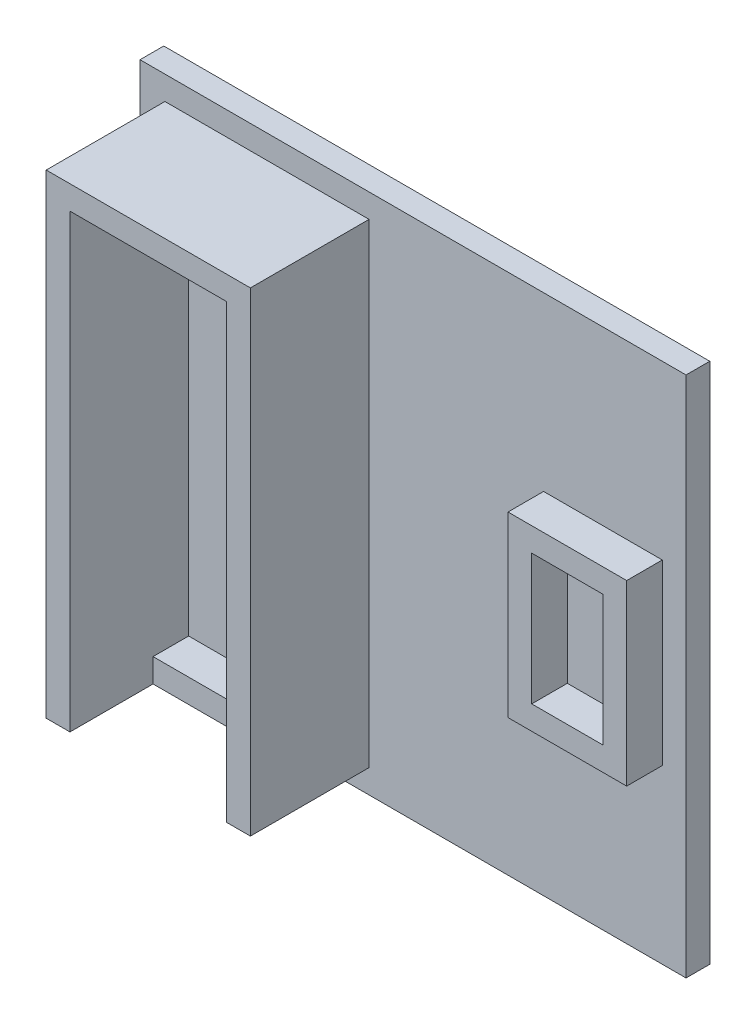
ISO-10303-21;
HEADER;
FILE_DESCRIPTION(('STEP AP214'),'2;1');
FILE_NAME('part.step','',(''),(''),'','','');
FILE_SCHEMA(('AUTOMOTIVE_DESIGN { 1 0 10303 214 1 1 1 1 }'));
ENDSEC;
DATA;
#1=APPLICATION_CONTEXT('core data for automotive mechanical design processes');
#2=APPLICATION_PROTOCOL_DEFINITION('international standard','automotive_design',2000,#1);
#3=PRODUCT_CONTEXT('',#1,'mechanical');
#4=PRODUCT('Part','Part','',(#3));
#5=PRODUCT_RELATED_PRODUCT_CATEGORY('part','',(#4));
#6=PRODUCT_DEFINITION_FORMATION('','',#4);
#7=PRODUCT_DEFINITION_CONTEXT('part definition',#1,'design');
#8=PRODUCT_DEFINITION('design','',#6,#7);
#9=PRODUCT_DEFINITION_SHAPE('','',#8);
#10=(LENGTH_UNIT() NAMED_UNIT(*) SI_UNIT(.MILLI.,.METRE.));
#11=(NAMED_UNIT(*) PLANE_ANGLE_UNIT() SI_UNIT($,.RADIAN.));
#12=(NAMED_UNIT(*) SI_UNIT($,.STERADIAN.) SOLID_ANGLE_UNIT());
#13=UNCERTAINTY_MEASURE_WITH_UNIT(LENGTH_MEASURE(1.E-05),#10,'distance_accuracy_value','');
#14=(GEOMETRIC_REPRESENTATION_CONTEXT(3) GLOBAL_UNCERTAINTY_ASSIGNED_CONTEXT((#13)) GLOBAL_UNIT_ASSIGNED_CONTEXT((#10,
#11,#12)) REPRESENTATION_CONTEXT('',''));
#15=CARTESIAN_POINT('',(0.,0.,0.));
#16=DIRECTION('',(0.,0.,1.));
#17=DIRECTION('',(1.,0.,0.));
#18=AXIS2_PLACEMENT_3D('',#15,#16,#17);
#19=CARTESIAN_POINT('',(0.,220.,10.));
#20=DIRECTION('',(0.,0.,-1.));
#21=DIRECTION('',(-1.,0.,0.));
#22=AXIS2_PLACEMENT_3D('',#19,#20,#21);
#23=PLANE('',#22);
#24=DIRECTION('',(0.,-1.,0.));
#25=VECTOR('',#24,1.);
#26=CARTESIAN_POINT('',(0.,0.,10.));
#27=LINE('',#26,#25);
#28=CARTESIAN_POINT('',(0.,220.,10.));
#29=VERTEX_POINT('',#28);
#30=CARTESIAN_POINT('',(0.,0.,10.));
#31=VERTEX_POINT('',#30);
#32=EDGE_CURVE('E329',#29,#31,#27,.T.);
#33=ORIENTED_EDGE('',*,*,#32,.T.);
#34=DIRECTION('',(1.,0.,0.));
#35=VECTOR('',#34,1.);
#36=CARTESIAN_POINT('',(0.,0.,10.));
#37=LINE('',#36,#35);
#38=CARTESIAN_POINT('',(230.,0.,10.));
#39=VERTEX_POINT('',#38);
#40=EDGE_CURVE('E332',#31,#39,#37,.T.);
#41=ORIENTED_EDGE('',*,*,#40,.T.);
#42=DIRECTION('',(0.,1.,0.));
#43=VECTOR('',#42,1.);
#44=CARTESIAN_POINT('',(230.,0.,10.));
#45=LINE('',#44,#43);
#46=CARTESIAN_POINT('',(230.,220.,10.));
#47=VERTEX_POINT('',#46);
#48=EDGE_CURVE('E335',#39,#47,#45,.T.);
#49=ORIENTED_EDGE('',*,*,#48,.T.);
#50=DIRECTION('',(-1.,0.,0.));
#51=VECTOR('',#50,1.);
#52=CARTESIAN_POINT('',(0.,220.,10.));
#53=LINE('',#52,#51);
#54=EDGE_CURVE('E337',#47,#29,#53,.T.);
#55=ORIENTED_EDGE('',*,*,#54,.T.);
#56=EDGE_LOOP('',(#33,#41,#49,#55));
#57=FACE_BOUND('',#56,.T.);
#58=DIRECTION('',(0.,1.,0.));
#59=VECTOR('',#58,1.);
#60=CARTESIAN_POINT('',(96.4871563645034,210.,10.));
#61=LINE('',#60,#59);
#62=CARTESIAN_POINT('',(96.4871563645034,9.99999999999995,10.));
#63=VERTEX_POINT('',#62);
#64=CARTESIAN_POINT('',(96.4871563645034,210.,10.));
#65=VERTEX_POINT('',#64);
#66=EDGE_CURVE('E300',#63,#65,#61,.T.);
#67=ORIENTED_EDGE('',*,*,#66,.F.);
#68=DIRECTION('',(1.,0.,0.));
#69=VECTOR('',#68,1.);
#70=CARTESIAN_POINT('',(10.4871563645034,9.99999999999995,10.));
#71=LINE('',#70,#69);
#72=CARTESIAN_POINT('',(10.4871563645034,9.99999999999995,10.));
#73=VERTEX_POINT('',#72);
#74=EDGE_CURVE('E290',#73,#63,#71,.T.);
#75=ORIENTED_EDGE('',*,*,#74,.F.);
#76=DIRECTION('',(0.,-1.,0.));
#77=VECTOR('',#76,1.);
#78=CARTESIAN_POINT('',(10.4871563645034,9.99999999999995,10.));
#79=LINE('',#78,#77);
#80=CARTESIAN_POINT('',(10.4871563645034,210.,10.));
#81=VERTEX_POINT('',#80);
#82=EDGE_CURVE('E268',#81,#73,#79,.T.);
#83=ORIENTED_EDGE('',*,*,#82,.F.);
#84=DIRECTION('',(-1.,0.,0.));
#85=VECTOR('',#84,1.);
#86=CARTESIAN_POINT('',(86.4871563645034,210.,10.));
#87=LINE('',#86,#85);
#88=EDGE_CURVE('E272',#65,#81,#87,.T.);
#89=ORIENTED_EDGE('',*,*,#88,.F.);
#90=EDGE_LOOP('',(#67,#75,#83,#89));
#91=FACE_BOUND('',#90,.T.);
#92=DIRECTION('',(0.,-1.,0.));
#93=VECTOR('',#92,1.);
#94=CARTESIAN_POINT('',(170.,147.5,10.));
#95=LINE('',#94,#93);
#96=CARTESIAN_POINT('',(170.,147.5,10.));
#97=VERTEX_POINT('',#96);
#98=CARTESIAN_POINT('',(170.,72.5,10.));
#99=VERTEX_POINT('',#98);
#100=EDGE_CURVE('E201',#97,#99,#95,.T.);
#101=ORIENTED_EDGE('',*,*,#100,.F.);
#102=DIRECTION('',(-1.,0.,0.));
#103=VECTOR('',#102,1.);
#104=CARTESIAN_POINT('',(170.,147.5,10.));
#105=LINE('',#104,#103);
#106=CARTESIAN_POINT('',(220.,147.5,10.));
#107=VERTEX_POINT('',#106);
#108=EDGE_CURVE('E229',#107,#97,#105,.T.);
#109=ORIENTED_EDGE('',*,*,#108,.F.);
#110=DIRECTION('',(0.,1.,0.));
#111=VECTOR('',#110,1.);
#112=CARTESIAN_POINT('',(220.,147.5,10.));
#113=LINE('',#112,#111);
#114=CARTESIAN_POINT('',(220.,72.5,10.));
#115=VERTEX_POINT('',#114);
#116=EDGE_CURVE('E55',#115,#107,#113,.T.);
#117=ORIENTED_EDGE('',*,*,#116,.F.);
#118=DIRECTION('',(1.,0.,0.));
#119=VECTOR('',#118,1.);
#120=CARTESIAN_POINT('',(170.,72.5,10.));
#121=LINE('',#120,#119);
#122=EDGE_CURVE('E50',#99,#115,#121,.T.);
#123=ORIENTED_EDGE('',*,*,#122,.F.);
#124=EDGE_LOOP('',(#101,#109,#117,#123));
#125=FACE_BOUND('',#124,.T.);
#126=ADVANCED_FACE('F35',(#57,#91,#125),#23,.F.);
#127=DIRECTION('',(-1.,0.,0.));
#128=VECTOR('',#127,1.);
#129=CARTESIAN_POINT('',(20.4871563645034,20.,10.));
#130=LINE('',#129,#128);
#131=CARTESIAN_POINT('',(86.4871563645034,20.,10.));
#132=VERTEX_POINT('',#131);
#133=CARTESIAN_POINT('',(20.4871563645034,20.,10.));
#134=VERTEX_POINT('',#133);
#135=EDGE_CURVE('E252',#132,#134,#130,.T.);
#136=ORIENTED_EDGE('',*,*,#135,.F.);
#137=DIRECTION('',(0.,-1.,0.));
#138=VECTOR('',#137,1.);
#139=CARTESIAN_POINT('',(86.4871563645034,200.,10.));
#140=LINE('',#139,#138);
#141=CARTESIAN_POINT('',(86.4871563645034,200.,10.));
#142=VERTEX_POINT('',#141);
#143=EDGE_CURVE('E297',#142,#132,#140,.T.);
#144=ORIENTED_EDGE('',*,*,#143,.F.);
#145=DIRECTION('',(1.,0.,0.));
#146=VECTOR('',#145,1.);
#147=CARTESIAN_POINT('',(20.4871563645034,200.,10.));
#148=LINE('',#147,#146);
#149=CARTESIAN_POINT('',(20.4871563645034,200.,10.));
#150=VERTEX_POINT('',#149);
#151=EDGE_CURVE('E294',#150,#142,#148,.T.);
#152=ORIENTED_EDGE('',*,*,#151,.F.);
#153=DIRECTION('',(0.,1.,0.));
#154=VECTOR('',#153,1.);
#155=CARTESIAN_POINT('',(20.4871563645034,9.99999999999995,10.));
#156=LINE('',#155,#154);
#157=EDGE_CURVE('E292',#134,#150,#156,.T.);
#158=ORIENTED_EDGE('',*,*,#157,.F.);
#159=EDGE_LOOP('',(#136,#144,#152,#158));
#160=FACE_BOUND('',#159,.T.);
#161=ADVANCED_FACE('F381',(#160),#23,.F.);
#162=CARTESIAN_POINT('',(20.4871563645034,9.99999999999995,60.));
#163=DIRECTION('',(-1.,0.,0.));
#164=DIRECTION('',(0.,0.,1.));
#165=AXIS2_PLACEMENT_3D('',#162,#163,#164);
#166=PLANE('',#165);
#167=DIRECTION('',(0.,0.,-1.));
#168=VECTOR('',#167,1.);
#169=CARTESIAN_POINT('',(20.4871563645034,20.,25.));
#170=LINE('',#169,#168);
#171=CARTESIAN_POINT('',(20.4871563645034,20.,25.));
#172=VERTEX_POINT('',#171);
#173=EDGE_CURVE('E262',#172,#134,#170,.T.);
#174=ORIENTED_EDGE('',*,*,#173,.T.);
#175=ORIENTED_EDGE('',*,*,#157,.T.);
#176=DIRECTION('',(0.,0.,-1.));
#177=VECTOR('',#176,1.);
#178=CARTESIAN_POINT('',(20.4871563645034,200.,60.));
#179=LINE('',#178,#177);
#180=CARTESIAN_POINT('',(20.4871563645034,200.,60.));
#181=VERTEX_POINT('',#180);
#182=EDGE_CURVE('E316',#181,#150,#179,.T.);
#183=ORIENTED_EDGE('',*,*,#182,.F.);
#184=DIRECTION('',(0.,1.,0.));
#185=VECTOR('',#184,1.);
#186=CARTESIAN_POINT('',(20.4871563645034,9.99999999999995,60.));
#187=LINE('',#186,#185);
#188=CARTESIAN_POINT('',(20.4871563645034,9.99999999999995,60.));
#189=VERTEX_POINT('',#188);
#190=EDGE_CURVE('E276',#189,#181,#187,.T.);
#191=ORIENTED_EDGE('',*,*,#190,.F.);
#192=DIRECTION('',(0.,0.,-1.));
#193=VECTOR('',#192,1.);
#194=CARTESIAN_POINT('',(20.4871563645034,9.99999999999995,60.));
#195=LINE('',#194,#193);
#196=CARTESIAN_POINT('',(20.4871563645034,9.99999999999995,25.));
#197=VERTEX_POINT('',#196);
#198=EDGE_CURVE('E319',#189,#197,#195,.T.);
#199=ORIENTED_EDGE('',*,*,#198,.T.);
#200=DIRECTION('',(0.,-1.,0.));
#201=VECTOR('',#200,1.);
#202=CARTESIAN_POINT('',(20.4871563645034,9.99999999999995,25.));
#203=LINE('',#202,#201);
#204=EDGE_CURVE('E253',#172,#197,#203,.T.);
#205=ORIENTED_EDGE('',*,*,#204,.F.);
#206=EDGE_LOOP('',(#174,#175,#183,#191,#199,#205));
#207=FACE_BOUND('',#206,.T.);
#208=ADVANCED_FACE('F387',(#207),#166,.F.);
#209=CARTESIAN_POINT('',(86.4871563645034,200.,60.));
#210=DIRECTION('',(1.,0.,0.));
#211=DIRECTION('',(0.,1.,0.));
#212=AXIS2_PLACEMENT_3D('',#209,#210,#211);
#213=PLANE('',#212);
#214=DIRECTION('',(0.,0.,-1.));
#215=VECTOR('',#214,1.);
#216=CARTESIAN_POINT('',(86.4871563645034,20.,25.));
#217=LINE('',#216,#215);
#218=CARTESIAN_POINT('',(86.4871563645034,20.,25.));
#219=VERTEX_POINT('',#218);
#220=EDGE_CURVE('E266',#219,#132,#217,.T.);
#221=ORIENTED_EDGE('',*,*,#220,.F.);
#222=DIRECTION('',(0.,1.,0.));
#223=VECTOR('',#222,1.);
#224=CARTESIAN_POINT('',(86.4871563645034,9.99999999999995,25.));
#225=LINE('',#224,#223);
#226=CARTESIAN_POINT('',(86.4871563645034,9.99999999999995,25.));
#227=VERTEX_POINT('',#226);
#228=EDGE_CURVE('E258',#227,#219,#225,.T.);
#229=ORIENTED_EDGE('',*,*,#228,.F.);
#230=DIRECTION('',(0.,0.,-1.));
#231=VECTOR('',#230,1.);
#232=CARTESIAN_POINT('',(86.4871563645034,9.99999999999996,60.));
#233=LINE('',#232,#231);
#234=CARTESIAN_POINT('',(86.4871563645034,9.99999999999996,60.));
#235=VERTEX_POINT('',#234);
#236=EDGE_CURVE('E310',#235,#227,#233,.T.);
#237=ORIENTED_EDGE('',*,*,#236,.F.);
#238=DIRECTION('',(0.,-1.,0.));
#239=VECTOR('',#238,1.);
#240=CARTESIAN_POINT('',(86.4871563645034,200.,60.));
#241=LINE('',#240,#239);
#242=CARTESIAN_POINT('',(86.4871563645034,200.,60.));
#243=VERTEX_POINT('',#242);
#244=EDGE_CURVE('E280',#243,#235,#241,.T.);
#245=ORIENTED_EDGE('',*,*,#244,.F.);
#246=DIRECTION('',(0.,0.,-1.));
#247=VECTOR('',#246,1.);
#248=CARTESIAN_POINT('',(86.4871563645034,200.,60.));
#249=LINE('',#248,#247);
#250=EDGE_CURVE('E313',#243,#142,#249,.T.);
#251=ORIENTED_EDGE('',*,*,#250,.T.);
#252=ORIENTED_EDGE('',*,*,#143,.T.);
#253=EDGE_LOOP('',(#221,#229,#237,#245,#251,#252));
#254=FACE_BOUND('',#253,.T.);
#255=ADVANCED_FACE('F379',(#254),#213,.F.);
#256=CARTESIAN_POINT('',(0.,0.,10.));
#257=DIRECTION('',(1.,0.,0.));
#258=DIRECTION('',(0.,0.,-1.));
#259=AXIS2_PLACEMENT_3D('',#256,#257,#258);
#260=PLANE('',#259);
#261=DIRECTION('',(0.,-1.,0.));
#262=VECTOR('',#261,1.);
#263=CARTESIAN_POINT('',(0.,0.,0.));
#264=LINE('',#263,#262);
#265=CARTESIAN_POINT('',(0.,220.,0.));
#266=VERTEX_POINT('',#265);
#267=CARTESIAN_POINT('',(0.,0.,0.));
#268=VERTEX_POINT('',#267);
#269=EDGE_CURVE('E328',#266,#268,#264,.T.);
#270=ORIENTED_EDGE('',*,*,#269,.T.);
#271=DIRECTION('',(0.,0.,-1.));
#272=VECTOR('',#271,1.);
#273=CARTESIAN_POINT('',(0.,0.,10.));
#274=LINE('',#273,#272);
#275=EDGE_CURVE('E11',#31,#268,#274,.T.);
#276=ORIENTED_EDGE('',*,*,#275,.F.);
#277=ORIENTED_EDGE('',*,*,#32,.F.);
#278=DIRECTION('',(0.,0.,-1.));
#279=VECTOR('',#278,1.);
#280=CARTESIAN_POINT('',(0.,220.,10.));
#281=LINE('',#280,#279);
#282=EDGE_CURVE('E339',#29,#266,#281,.T.);
#283=ORIENTED_EDGE('',*,*,#282,.T.);
#284=EDGE_LOOP('',(#270,#276,#277,#283));
#285=FACE_BOUND('',#284,.T.);
#286=ADVANCED_FACE('F37',(#285),#260,.F.);
#287=CARTESIAN_POINT('',(0.,0.,10.));
#288=DIRECTION('',(0.,1.,0.));
#289=DIRECTION('',(0.,0.,1.));
#290=AXIS2_PLACEMENT_3D('',#287,#288,#289);
#291=PLANE('',#290);
#292=DIRECTION('',(1.,0.,0.));
#293=VECTOR('',#292,1.);
#294=CARTESIAN_POINT('',(0.,0.,0.));
#295=LINE('',#294,#293);
#296=CARTESIAN_POINT('',(230.,0.,0.));
#297=VERTEX_POINT('',#296);
#298=EDGE_CURVE('E342',#268,#297,#295,.T.);
#299=ORIENTED_EDGE('',*,*,#298,.T.);
#300=DIRECTION('',(0.,0.,-1.));
#301=VECTOR('',#300,1.);
#302=CARTESIAN_POINT('',(230.,0.,10.));
#303=LINE('',#302,#301);
#304=EDGE_CURVE('E43',#39,#297,#303,.T.);
#305=ORIENTED_EDGE('',*,*,#304,.F.);
#306=ORIENTED_EDGE('',*,*,#40,.F.);
#307=ORIENTED_EDGE('',*,*,#275,.T.);
#308=EDGE_LOOP('',(#299,#305,#306,#307));
#309=FACE_BOUND('',#308,.T.);
#310=ADVANCED_FACE('F372',(#309),#291,.F.);
#311=CARTESIAN_POINT('',(230.,0.,10.));
#312=DIRECTION('',(-1.,0.,0.));
#313=DIRECTION('',(0.,0.,1.));
#314=AXIS2_PLACEMENT_3D('',#311,#312,#313);
#315=PLANE('',#314);
#316=DIRECTION('',(0.,1.,0.));
#317=VECTOR('',#316,1.);
#318=CARTESIAN_POINT('',(230.,0.,0.));
#319=LINE('',#318,#317);
#320=CARTESIAN_POINT('',(230.,220.,0.));
#321=VERTEX_POINT('',#320);
#322=EDGE_CURVE('E344',#297,#321,#319,.T.);
#323=ORIENTED_EDGE('',*,*,#322,.T.);
#324=DIRECTION('',(0.,0.,-1.));
#325=VECTOR('',#324,1.);
#326=CARTESIAN_POINT('',(230.,220.,10.));
#327=LINE('',#326,#325);
#328=EDGE_CURVE('E349',#47,#321,#327,.T.);
#329=ORIENTED_EDGE('',*,*,#328,.F.);
#330=ORIENTED_EDGE('',*,*,#48,.F.);
#331=ORIENTED_EDGE('',*,*,#304,.T.);
#332=EDGE_LOOP('',(#323,#329,#330,#331));
#333=FACE_BOUND('',#332,.T.);
#334=ADVANCED_FACE('F356',(#333),#315,.F.);
#335=CARTESIAN_POINT('',(0.,220.,10.));
#336=DIRECTION('',(0.,-1.,0.));
#337=DIRECTION('',(0.,0.,-1.));
#338=AXIS2_PLACEMENT_3D('',#335,#336,#337);
#339=PLANE('',#338);
#340=DIRECTION('',(-1.,0.,0.));
#341=VECTOR('',#340,1.);
#342=CARTESIAN_POINT('',(0.,220.,0.));
#343=LINE('',#342,#341);
#344=EDGE_CURVE('E333',#321,#266,#343,.T.);
#345=ORIENTED_EDGE('',*,*,#344,.T.);
#346=ORIENTED_EDGE('',*,*,#282,.F.);
#347=ORIENTED_EDGE('',*,*,#54,.F.);
#348=ORIENTED_EDGE('',*,*,#328,.T.);
#349=EDGE_LOOP('',(#345,#346,#347,#348));
#350=FACE_BOUND('',#349,.T.);
#351=ADVANCED_FACE('F365',(#350),#339,.F.);
#352=CARTESIAN_POINT('',(0.,220.,0.));
#353=DIRECTION('',(0.,0.,-1.));
#354=DIRECTION('',(-1.,0.,0.));
#355=AXIS2_PLACEMENT_3D('',#352,#353,#354);
#356=PLANE('',#355);
#357=ORIENTED_EDGE('',*,*,#269,.F.);
#358=ORIENTED_EDGE('',*,*,#344,.F.);
#359=ORIENTED_EDGE('',*,*,#322,.F.);
#360=ORIENTED_EDGE('',*,*,#298,.F.);
#361=EDGE_LOOP('',(#357,#358,#359,#360));
#362=FACE_BOUND('',#361,.T.);
#363=ADVANCED_FACE('F362',(#362),#356,.T.);
#364=CARTESIAN_POINT('',(10.4871563645034,9.99999999999995,60.));
#365=DIRECTION('',(1.,0.,0.));
#366=DIRECTION('',(0.,0.,-1.));
#367=AXIS2_PLACEMENT_3D('',#364,#365,#366);
#368=PLANE('',#367);
#369=ORIENTED_EDGE('',*,*,#82,.T.);
#370=DIRECTION('',(0.,0.,-1.));
#371=VECTOR('',#370,1.);
#372=CARTESIAN_POINT('',(10.4871563645034,9.99999999999995,60.));
#373=LINE('',#372,#371);
#374=CARTESIAN_POINT('',(10.4871563645034,9.99999999999995,60.));
#375=VERTEX_POINT('',#374);
#376=EDGE_CURVE('E322',#375,#73,#373,.T.);
#377=ORIENTED_EDGE('',*,*,#376,.F.);
#378=DIRECTION('',(0.,-1.,0.));
#379=VECTOR('',#378,1.);
#380=CARTESIAN_POINT('',(10.4871563645034,9.99999999999995,60.));
#381=LINE('',#380,#379);
#382=CARTESIAN_POINT('',(10.4871563645034,210.,60.));
#383=VERTEX_POINT('',#382);
#384=EDGE_CURVE('E271',#383,#375,#381,.T.);
#385=ORIENTED_EDGE('',*,*,#384,.F.);
#386=DIRECTION('',(0.,0.,-1.));
#387=VECTOR('',#386,1.);
#388=CARTESIAN_POINT('',(10.4871563645034,210.,60.));
#389=LINE('',#388,#387);
#390=EDGE_CURVE('E325',#383,#81,#389,.T.);
#391=ORIENTED_EDGE('',*,*,#390,.T.);
#392=EDGE_LOOP('',(#369,#377,#385,#391));
#393=FACE_BOUND('',#392,.T.);
#394=ADVANCED_FACE('F463',(#393),#368,.F.);
#395=CARTESIAN_POINT('',(10.4871563645034,9.99999999999995,60.));
#396=DIRECTION('',(0.,1.,0.));
#397=DIRECTION('',(0.,0.,1.));
#398=AXIS2_PLACEMENT_3D('',#395,#396,#397);
#399=PLANE('',#398);
#400=ORIENTED_EDGE('',*,*,#74,.T.);
#401=DIRECTION('',(0.,0.,-1.));
#402=VECTOR('',#401,1.);
#403=CARTESIAN_POINT('',(96.4871563645034,9.99999999999995,60.));
#404=LINE('',#403,#402);
#405=CARTESIAN_POINT('',(96.4871563645034,9.99999999999995,60.));
#406=VERTEX_POINT('',#405);
#407=EDGE_CURVE('E307',#406,#63,#404,.T.);
#408=ORIENTED_EDGE('',*,*,#407,.F.);
#409=DIRECTION('',(1.,0.,0.));
#410=VECTOR('',#409,1.);
#411=CARTESIAN_POINT('',(86.4871563645034,9.99999999999996,60.));
#412=LINE('',#411,#410);
#413=EDGE_CURVE('E282',#235,#406,#412,.T.);
#414=ORIENTED_EDGE('',*,*,#413,.F.);
#415=ORIENTED_EDGE('',*,*,#236,.T.);
#416=DIRECTION('',(1.,0.,0.));
#417=VECTOR('',#416,1.);
#418=CARTESIAN_POINT('',(20.4871563645034,9.99999999999995,25.));
#419=LINE('',#418,#417);
#420=EDGE_CURVE('E256',#197,#227,#419,.T.);
#421=ORIENTED_EDGE('',*,*,#420,.F.);
#422=ORIENTED_EDGE('',*,*,#198,.F.);
#423=DIRECTION('',(1.,0.,0.));
#424=VECTOR('',#423,1.);
#425=CARTESIAN_POINT('',(10.4871563645034,9.99999999999995,60.));
#426=LINE('',#425,#424);
#427=EDGE_CURVE('E274',#375,#189,#426,.T.);
#428=ORIENTED_EDGE('',*,*,#427,.F.);
#429=ORIENTED_EDGE('',*,*,#376,.T.);
#430=EDGE_LOOP('',(#400,#408,#414,#415,#421,#422,#428,#429));
#431=FACE_BOUND('',#430,.T.);
#432=ADVANCED_FACE('F457',(#431),#399,.F.);
#433=CARTESIAN_POINT('',(20.4871563645034,200.,60.));
#434=DIRECTION('',(0.,1.,0.));
#435=DIRECTION('',(-1.,0.,0.));
#436=AXIS2_PLACEMENT_3D('',#433,#434,#435);
#437=PLANE('',#436);
#438=ORIENTED_EDGE('',*,*,#151,.T.);
#439=ORIENTED_EDGE('',*,*,#250,.F.);
#440=DIRECTION('',(1.,0.,0.));
#441=VECTOR('',#440,1.);
#442=CARTESIAN_POINT('',(20.4871563645034,200.,60.));
#443=LINE('',#442,#441);
#444=EDGE_CURVE('E278',#181,#243,#443,.T.);
#445=ORIENTED_EDGE('',*,*,#444,.F.);
#446=ORIENTED_EDGE('',*,*,#182,.T.);
#447=EDGE_LOOP('',(#438,#439,#445,#446));
#448=FACE_BOUND('',#447,.T.);
#449=ADVANCED_FACE('F450',(#448),#437,.F.);
#450=CARTESIAN_POINT('',(96.4871563645034,210.,60.));
#451=DIRECTION('',(-1.,0.,0.));
#452=DIRECTION('',(0.,-1.,0.));
#453=AXIS2_PLACEMENT_3D('',#450,#451,#452);
#454=PLANE('',#453);
#455=ORIENTED_EDGE('',*,*,#66,.T.);
#456=DIRECTION('',(0.,0.,-1.));
#457=VECTOR('',#456,1.);
#458=CARTESIAN_POINT('',(96.4871563645034,210.,60.));
#459=LINE('',#458,#457);
#460=CARTESIAN_POINT('',(96.4871563645034,210.,60.));
#461=VERTEX_POINT('',#460);
#462=EDGE_CURVE('E287',#461,#65,#459,.T.);
#463=ORIENTED_EDGE('',*,*,#462,.F.);
#464=DIRECTION('',(0.,1.,0.));
#465=VECTOR('',#464,1.);
#466=CARTESIAN_POINT('',(96.4871563645034,210.,60.));
#467=LINE('',#466,#465);
#468=EDGE_CURVE('E284',#406,#461,#467,.T.);
#469=ORIENTED_EDGE('',*,*,#468,.F.);
#470=ORIENTED_EDGE('',*,*,#407,.T.);
#471=EDGE_LOOP('',(#455,#463,#469,#470));
#472=FACE_BOUND('',#471,.T.);
#473=ADVANCED_FACE('F446',(#472),#454,.F.);
#474=CARTESIAN_POINT('',(86.4871563645034,210.,60.));
#475=DIRECTION('',(0.,-1.,0.));
#476=DIRECTION('',(1.,0.,0.));
#477=AXIS2_PLACEMENT_3D('',#474,#475,#476);
#478=PLANE('',#477);
#479=ORIENTED_EDGE('',*,*,#88,.T.);
#480=ORIENTED_EDGE('',*,*,#390,.F.);
#481=DIRECTION('',(-1.,0.,0.));
#482=VECTOR('',#481,1.);
#483=CARTESIAN_POINT('',(20.4871563645034,210.,60.));
#484=LINE('',#483,#482);
#485=EDGE_CURVE('E269',#461,#383,#484,.T.);
#486=ORIENTED_EDGE('',*,*,#485,.F.);
#487=ORIENTED_EDGE('',*,*,#462,.T.);
#488=EDGE_LOOP('',(#479,#480,#486,#487));
#489=FACE_BOUND('',#488,.T.);
#490=ADVANCED_FACE('F442',(#489),#478,.F.);
#491=CARTESIAN_POINT('',(96.4871563645034,210.,60.));
#492=DIRECTION('',(0.,0.,-1.));
#493=DIRECTION('',(-1.,0.,0.));
#494=AXIS2_PLACEMENT_3D('',#491,#492,#493);
#495=PLANE('',#494);
#496=ORIENTED_EDGE('',*,*,#485,.T.);
#497=ORIENTED_EDGE('',*,*,#384,.T.);
#498=ORIENTED_EDGE('',*,*,#427,.T.);
#499=ORIENTED_EDGE('',*,*,#190,.T.);
#500=ORIENTED_EDGE('',*,*,#444,.T.);
#501=ORIENTED_EDGE('',*,*,#244,.T.);
#502=ORIENTED_EDGE('',*,*,#413,.T.);
#503=ORIENTED_EDGE('',*,*,#468,.T.);
#504=EDGE_LOOP('',(#496,#497,#498,#499,#500,#501,#502,#503));
#505=FACE_BOUND('',#504,.T.);
#506=ADVANCED_FACE('F438',(#505),#495,.F.);
#507=CARTESIAN_POINT('',(20.4871563645034,20.,25.));
#508=DIRECTION('',(0.,-1.,0.));
#509=DIRECTION('',(1.,0.,0.));
#510=AXIS2_PLACEMENT_3D('',#507,#508,#509);
#511=PLANE('',#510);
#512=ORIENTED_EDGE('',*,*,#135,.T.);
#513=ORIENTED_EDGE('',*,*,#173,.F.);
#514=DIRECTION('',(-1.,0.,0.));
#515=VECTOR('',#514,1.);
#516=CARTESIAN_POINT('',(20.4871563645034,20.,25.));
#517=LINE('',#516,#515);
#518=EDGE_CURVE('E260',#219,#172,#517,.T.);
#519=ORIENTED_EDGE('',*,*,#518,.F.);
#520=ORIENTED_EDGE('',*,*,#220,.T.);
#521=EDGE_LOOP('',(#512,#513,#519,#520));
#522=FACE_BOUND('',#521,.T.);
#523=ADVANCED_FACE('F434',(#522),#511,.F.);
#524=CARTESIAN_POINT('',(20.4871563645034,20.,25.));
#525=DIRECTION('',(0.,0.,-1.));
#526=DIRECTION('',(-1.,0.,0.));
#527=AXIS2_PLACEMENT_3D('',#524,#525,#526);
#528=PLANE('',#527);
#529=ORIENTED_EDGE('',*,*,#204,.T.);
#530=ORIENTED_EDGE('',*,*,#420,.T.);
#531=ORIENTED_EDGE('',*,*,#228,.T.);
#532=ORIENTED_EDGE('',*,*,#518,.T.);
#533=EDGE_LOOP('',(#529,#530,#531,#532));
#534=FACE_BOUND('',#533,.T.);
#535=ADVANCED_FACE('F416',(#534),#528,.F.);
#536=CARTESIAN_POINT('',(170.,72.5,25.));
#537=DIRECTION('',(0.,0.,1.));
#538=DIRECTION('',(1.,0.,0.));
#539=AXIS2_PLACEMENT_3D('',#536,#537,#538);
#540=PLANE('',#539);
#541=DIRECTION('',(0.,-1.,0.));
#542=VECTOR('',#541,1.);
#543=CARTESIAN_POINT('',(170.,147.5,25.));
#544=LINE('',#543,#542);
#545=CARTESIAN_POINT('',(170.,147.5,25.));
#546=VERTEX_POINT('',#545);
#547=CARTESIAN_POINT('',(170.,72.5,25.));
#548=VERTEX_POINT('',#547);
#549=EDGE_CURVE('E225',#546,#548,#544,.T.);
#550=ORIENTED_EDGE('',*,*,#549,.T.);
#551=DIRECTION('',(1.,0.,0.));
#552=VECTOR('',#551,1.);
#553=CARTESIAN_POINT('',(170.,72.5,25.));
#554=LINE('',#553,#552);
#555=CARTESIAN_POINT('',(220.,72.5,25.));
#556=VERTEX_POINT('',#555);
#557=EDGE_CURVE('E228',#548,#556,#554,.T.);
#558=ORIENTED_EDGE('',*,*,#557,.T.);
#559=DIRECTION('',(0.,1.,0.));
#560=VECTOR('',#559,1.);
#561=CARTESIAN_POINT('',(220.,147.5,25.));
#562=LINE('',#561,#560);
#563=CARTESIAN_POINT('',(220.,147.5,25.));
#564=VERTEX_POINT('',#563);
#565=EDGE_CURVE('E231',#556,#564,#562,.T.);
#566=ORIENTED_EDGE('',*,*,#565,.T.);
#567=DIRECTION('',(-1.,0.,0.));
#568=VECTOR('',#567,1.);
#569=CARTESIAN_POINT('',(170.,147.5,25.));
#570=LINE('',#569,#568);
#571=EDGE_CURVE('E233',#564,#546,#570,.T.);
#572=ORIENTED_EDGE('',*,*,#571,.T.);
#573=EDGE_LOOP('',(#550,#558,#566,#572));
#574=FACE_BOUND('',#573,.T.);
#575=DIRECTION('',(1.,0.,0.));
#576=VECTOR('',#575,1.);
#577=CARTESIAN_POINT('',(180.,82.5,25.));
#578=LINE('',#577,#576);
#579=CARTESIAN_POINT('',(180.,82.5,25.));
#580=VERTEX_POINT('',#579);
#581=CARTESIAN_POINT('',(210.,82.5,25.));
#582=VERTEX_POINT('',#581);
#583=EDGE_CURVE('E193',#580,#582,#578,.T.);
#584=ORIENTED_EDGE('',*,*,#583,.F.);
#585=DIRECTION('',(0.,-1.,0.));
#586=VECTOR('',#585,1.);
#587=CARTESIAN_POINT('',(180.,137.5,25.));
#588=LINE('',#587,#586);
#589=CARTESIAN_POINT('',(180.,137.5,25.));
#590=VERTEX_POINT('',#589);
#591=EDGE_CURVE('E183',#590,#580,#588,.T.);
#592=ORIENTED_EDGE('',*,*,#591,.F.);
#593=DIRECTION('',(-1.,0.,0.));
#594=VECTOR('',#593,1.);
#595=CARTESIAN_POINT('',(180.,137.5,25.));
#596=LINE('',#595,#594);
#597=CARTESIAN_POINT('',(210.,137.5,25.));
#598=VERTEX_POINT('',#597);
#599=EDGE_CURVE('E209',#598,#590,#596,.T.);
#600=ORIENTED_EDGE('',*,*,#599,.F.);
#601=DIRECTION('',(0.,1.,0.));
#602=VECTOR('',#601,1.);
#603=CARTESIAN_POINT('',(210.,137.5,25.));
#604=LINE('',#603,#602);
#605=EDGE_CURVE('E207',#582,#598,#604,.T.);
#606=ORIENTED_EDGE('',*,*,#605,.F.);
#607=EDGE_LOOP('',(#584,#592,#600,#606));
#608=FACE_BOUND('',#607,.T.);
#609=ADVANCED_FACE('F205',(#574,#608),#540,.T.);
#610=CARTESIAN_POINT('',(170.,147.5,25.));
#611=DIRECTION('',(1.,0.,0.));
#612=DIRECTION('',(0.,0.,-1.));
#613=AXIS2_PLACEMENT_3D('',#610,#611,#612);
#614=PLANE('',#613);
#615=ORIENTED_EDGE('',*,*,#100,.T.);
#616=DIRECTION('',(0.,0.,-1.));
#617=VECTOR('',#616,1.);
#618=CARTESIAN_POINT('',(170.,72.5,25.));
#619=LINE('',#618,#617);
#620=EDGE_CURVE('E250',#548,#99,#619,.T.);
#621=ORIENTED_EDGE('',*,*,#620,.F.);
#622=ORIENTED_EDGE('',*,*,#549,.F.);
#623=DIRECTION('',(0.,0.,-1.));
#624=VECTOR('',#623,1.);
#625=CARTESIAN_POINT('',(170.,147.5,25.));
#626=LINE('',#625,#624);
#627=EDGE_CURVE('E235',#546,#97,#626,.T.);
#628=ORIENTED_EDGE('',*,*,#627,.T.);
#629=EDGE_LOOP('',(#615,#621,#622,#628));
#630=FACE_BOUND('',#629,.T.);
#631=ADVANCED_FACE('F415',(#630),#614,.F.);
#632=CARTESIAN_POINT('',(170.,72.5,25.));
#633=DIRECTION('',(0.,1.,0.));
#634=DIRECTION('',(0.,0.,1.));
#635=AXIS2_PLACEMENT_3D('',#632,#633,#634);
#636=PLANE('',#635);
#637=ORIENTED_EDGE('',*,*,#122,.T.);
#638=DIRECTION('',(0.,0.,-1.));
#639=VECTOR('',#638,1.);
#640=CARTESIAN_POINT('',(220.,72.5,25.));
#641=LINE('',#640,#639);
#642=EDGE_CURVE('E247',#556,#115,#641,.T.);
#643=ORIENTED_EDGE('',*,*,#642,.F.);
#644=ORIENTED_EDGE('',*,*,#557,.F.);
#645=ORIENTED_EDGE('',*,*,#620,.T.);
#646=EDGE_LOOP('',(#637,#643,#644,#645));
#647=FACE_BOUND('',#646,.T.);
#648=ADVANCED_FACE('F424',(#647),#636,.F.);
#649=CARTESIAN_POINT('',(220.,147.5,25.));
#650=DIRECTION('',(-1.,0.,0.));
#651=DIRECTION('',(0.,0.,1.));
#652=AXIS2_PLACEMENT_3D('',#649,#650,#651);
#653=PLANE('',#652);
#654=ORIENTED_EDGE('',*,*,#116,.T.);
#655=DIRECTION('',(0.,0.,-1.));
#656=VECTOR('',#655,1.);
#657=CARTESIAN_POINT('',(220.,147.5,25.));
#658=LINE('',#657,#656);
#659=EDGE_CURVE('E244',#564,#107,#658,.T.);
#660=ORIENTED_EDGE('',*,*,#659,.F.);
#661=ORIENTED_EDGE('',*,*,#565,.F.);
#662=ORIENTED_EDGE('',*,*,#642,.T.);
#663=EDGE_LOOP('',(#654,#660,#661,#662));
#664=FACE_BOUND('',#663,.T.);
#665=ADVANCED_FACE('F420',(#664),#653,.F.);
#666=CARTESIAN_POINT('',(170.,147.5,25.));
#667=DIRECTION('',(0.,-1.,0.));
#668=DIRECTION('',(0.,0.,-1.));
#669=AXIS2_PLACEMENT_3D('',#666,#667,#668);
#670=PLANE('',#669);
#671=ORIENTED_EDGE('',*,*,#108,.T.);
#672=ORIENTED_EDGE('',*,*,#627,.F.);
#673=ORIENTED_EDGE('',*,*,#571,.F.);
#674=ORIENTED_EDGE('',*,*,#659,.T.);
#675=EDGE_LOOP('',(#671,#672,#673,#674));
#676=FACE_BOUND('',#675,.T.);
#677=ADVANCED_FACE('F412',(#676),#670,.F.);
#678=CARTESIAN_POINT('',(180.,137.5,25.));
#679=DIRECTION('',(1.,0.,0.));
#680=DIRECTION('',(0.,1.,0.));
#681=AXIS2_PLACEMENT_3D('',#678,#679,#680);
#682=PLANE('',#681);
#683=DIRECTION('',(0.,-1.,0.));
#684=VECTOR('',#683,1.);
#685=CARTESIAN_POINT('',(180.,137.5,10.));
#686=LINE('',#685,#684);
#687=CARTESIAN_POINT('',(180.,137.5,10.));
#688=VERTEX_POINT('',#687);
#689=CARTESIAN_POINT('',(180.,82.5,10.));
#690=VERTEX_POINT('',#689);
#691=EDGE_CURVE('E213',#688,#690,#686,.T.);
#692=ORIENTED_EDGE('',*,*,#691,.F.);
#693=DIRECTION('',(0.,0.,-1.));
#694=VECTOR('',#693,1.);
#695=CARTESIAN_POINT('',(180.,137.5,25.));
#696=LINE('',#695,#694);
#697=EDGE_CURVE('E189',#590,#688,#696,.T.);
#698=ORIENTED_EDGE('',*,*,#697,.F.);
#699=ORIENTED_EDGE('',*,*,#591,.T.);
#700=DIRECTION('',(0.,0.,-1.));
#701=VECTOR('',#700,1.);
#702=CARTESIAN_POINT('',(180.,82.5,25.));
#703=LINE('',#702,#701);
#704=EDGE_CURVE('E187',#580,#690,#703,.T.);
#705=ORIENTED_EDGE('',*,*,#704,.T.);
#706=EDGE_LOOP('',(#692,#698,#699,#705));
#707=FACE_BOUND('',#706,.T.);
#708=ADVANCED_FACE('F186',(#707),#682,.T.);
#709=CARTESIAN_POINT('',(180.,82.5,25.));
#710=DIRECTION('',(0.,1.,0.));
#711=DIRECTION('',(0.,0.,1.));
#712=AXIS2_PLACEMENT_3D('',#709,#710,#711);
#713=PLANE('',#712);
#714=DIRECTION('',(1.,0.,0.));
#715=VECTOR('',#714,1.);
#716=CARTESIAN_POINT('',(180.,82.5,10.));
#717=LINE('',#716,#715);
#718=CARTESIAN_POINT('',(210.,82.5,10.));
#719=VERTEX_POINT('',#718);
#720=EDGE_CURVE('E200',#690,#719,#717,.T.);
#721=ORIENTED_EDGE('',*,*,#720,.F.);
#722=ORIENTED_EDGE('',*,*,#704,.F.);
#723=ORIENTED_EDGE('',*,*,#583,.T.);
#724=DIRECTION('',(0.,0.,-1.));
#725=VECTOR('',#724,1.);
#726=CARTESIAN_POINT('',(210.,82.5,25.));
#727=LINE('',#726,#725);
#728=EDGE_CURVE('E202',#582,#719,#727,.T.);
#729=ORIENTED_EDGE('',*,*,#728,.T.);
#730=EDGE_LOOP('',(#721,#722,#723,#729));
#731=FACE_BOUND('',#730,.T.);
#732=ADVANCED_FACE('F197',(#731),#713,.T.);
#733=CARTESIAN_POINT('',(210.,137.5,25.));
#734=DIRECTION('',(-1.,0.,0.));
#735=DIRECTION('',(0.,0.,1.));
#736=AXIS2_PLACEMENT_3D('',#733,#734,#735);
#737=PLANE('',#736);
#738=DIRECTION('',(0.,1.,0.));
#739=VECTOR('',#738,1.);
#740=CARTESIAN_POINT('',(210.,137.5,10.));
#741=LINE('',#740,#739);
#742=CARTESIAN_POINT('',(210.,137.5,10.));
#743=VERTEX_POINT('',#742);
#744=EDGE_CURVE('E216',#719,#743,#741,.T.);
#745=ORIENTED_EDGE('',*,*,#744,.F.);
#746=ORIENTED_EDGE('',*,*,#728,.F.);
#747=ORIENTED_EDGE('',*,*,#605,.T.);
#748=DIRECTION('',(0.,0.,-1.));
#749=VECTOR('',#748,1.);
#750=CARTESIAN_POINT('',(210.,137.5,25.));
#751=LINE('',#750,#749);
#752=EDGE_CURVE('E222',#598,#743,#751,.T.);
#753=ORIENTED_EDGE('',*,*,#752,.T.);
#754=EDGE_LOOP('',(#745,#746,#747,#753));
#755=FACE_BOUND('',#754,.T.);
#756=ADVANCED_FACE('F397',(#755),#737,.T.);
#757=CARTESIAN_POINT('',(180.,137.5,25.));
#758=DIRECTION('',(0.,-1.,0.));
#759=DIRECTION('',(0.,0.,-1.));
#760=AXIS2_PLACEMENT_3D('',#757,#758,#759);
#761=PLANE('',#760);
#762=DIRECTION('',(-1.,0.,0.));
#763=VECTOR('',#762,1.);
#764=CARTESIAN_POINT('',(180.,137.5,10.));
#765=LINE('',#764,#763);
#766=EDGE_CURVE('E194',#743,#688,#765,.T.);
#767=ORIENTED_EDGE('',*,*,#766,.F.);
#768=ORIENTED_EDGE('',*,*,#752,.F.);
#769=ORIENTED_EDGE('',*,*,#599,.T.);
#770=ORIENTED_EDGE('',*,*,#697,.T.);
#771=EDGE_LOOP('',(#767,#768,#769,#770));
#772=FACE_BOUND('',#771,.T.);
#773=ADVANCED_FACE('F392',(#772),#761,.T.);
#774=ORIENTED_EDGE('',*,*,#766,.T.);
#775=ORIENTED_EDGE('',*,*,#691,.T.);
#776=ORIENTED_EDGE('',*,*,#720,.T.);
#777=ORIENTED_EDGE('',*,*,#744,.T.);
#778=EDGE_LOOP('',(#774,#775,#776,#777));
#779=FACE_BOUND('',#778,.T.);
#780=ADVANCED_FACE('F383',(#779),#23,.F.);
#781=CLOSED_SHELL('',(#126,#161,#208,#255,#286,#310,#334,#351,#363,#394,#432,#449,#473,#490,
#506,#523,#535,#609,#631,#648,#665,#677,#708,#732,#756,#773,#780));
#782=MANIFOLD_SOLID_BREP('B2',#781);
#783=ADVANCED_BREP_SHAPE_REPRESENTATION('',(#18,#782),#14);
#784=SHAPE_DEFINITION_REPRESENTATION(#9,#783);
ENDSEC;
END-ISO-10303-21;
